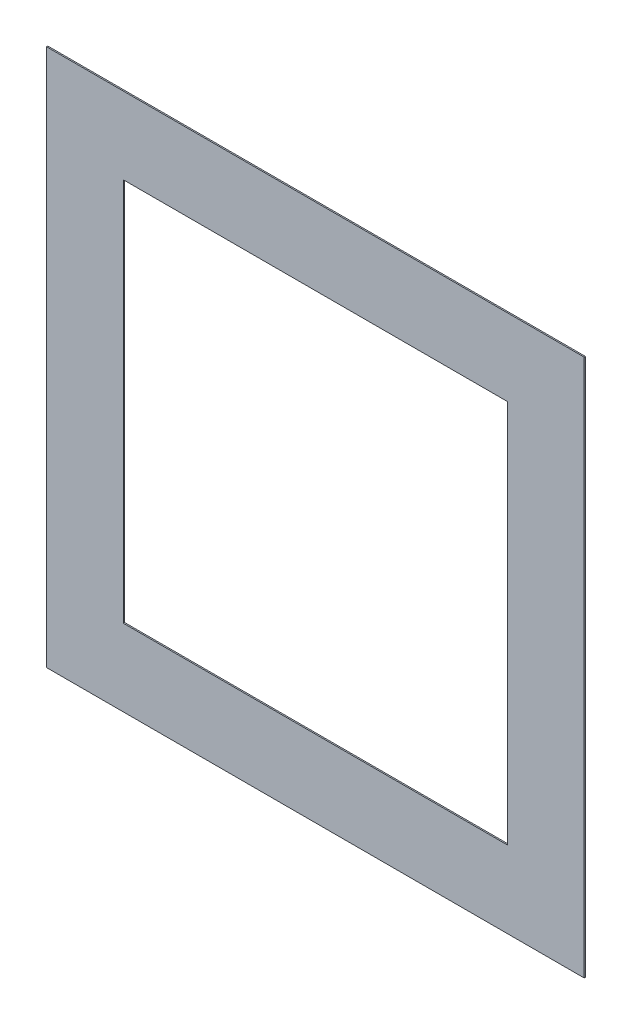
ISO-10303-21;
HEADER;
FILE_DESCRIPTION(('STEP AP214'),'2;1');
FILE_NAME('part.step','',(''),(''),'','','');
FILE_SCHEMA(('AUTOMOTIVE_DESIGN { 1 0 10303 214 1 1 1 1 }'));
ENDSEC;
DATA;
#1=APPLICATION_CONTEXT('core data for automotive mechanical design processes');
#2=APPLICATION_PROTOCOL_DEFINITION('international standard','automotive_design',2000,#1);
#3=PRODUCT_CONTEXT('',#1,'mechanical');
#4=PRODUCT('Part','Part','',(#3));
#5=PRODUCT_RELATED_PRODUCT_CATEGORY('part','',(#4));
#6=PRODUCT_DEFINITION_FORMATION('','',#4);
#7=PRODUCT_DEFINITION_CONTEXT('part definition',#1,'design');
#8=PRODUCT_DEFINITION('design','',#6,#7);
#9=PRODUCT_DEFINITION_SHAPE('','',#8);
#10=(LENGTH_UNIT() NAMED_UNIT(*) SI_UNIT(.MILLI.,.METRE.));
#11=(NAMED_UNIT(*) PLANE_ANGLE_UNIT() SI_UNIT($,.RADIAN.));
#12=(NAMED_UNIT(*) SI_UNIT($,.STERADIAN.) SOLID_ANGLE_UNIT());
#13=UNCERTAINTY_MEASURE_WITH_UNIT(LENGTH_MEASURE(1.E-05),#10,'distance_accuracy_value','');
#14=(GEOMETRIC_REPRESENTATION_CONTEXT(3) GLOBAL_UNCERTAINTY_ASSIGNED_CONTEXT((#13)) GLOBAL_UNIT_ASSIGNED_CONTEXT((#10,
#11,#12)) REPRESENTATION_CONTEXT('',''));
#15=CARTESIAN_POINT('',(0.,0.,0.));
#16=DIRECTION('',(0.,0.,1.));
#17=DIRECTION('',(1.,0.,0.));
#18=AXIS2_PLACEMENT_3D('',#15,#16,#17);
#19=CARTESIAN_POINT('',(-994.520547945205,571.232876712329,5.));
#20=DIRECTION('',(1.,0.,0.));
#21=DIRECTION('',(0.,1.,0.));
#22=AXIS2_PLACEMENT_3D('',#19,#20,#21);
#23=PLANE('',#22);
#24=DIRECTION('',(0.,-1.,0.));
#25=VECTOR('',#24,1.);
#26=CARTESIAN_POINT('',(-994.520547945205,571.232876712329,0.));
#27=LINE('',#26,#25);
#28=CARTESIAN_POINT('',(-994.520547945205,571.232876712329,0.));
#29=VERTEX_POINT('',#28);
#30=CARTESIAN_POINT('',(-994.520547945205,-1528.76712328767,0.));
#31=VERTEX_POINT('',#30);
#32=EDGE_CURVE('E132',#29,#31,#27,.T.);
#33=ORIENTED_EDGE('',*,*,#32,.T.);
#34=DIRECTION('',(0.,0.,-1.));
#35=VECTOR('',#34,1.);
#36=CARTESIAN_POINT('',(-994.520547945205,-1528.76712328767,5.));
#37=LINE('',#36,#35);
#38=CARTESIAN_POINT('',(-994.520547945205,-1528.76712328767,5.));
#39=VERTEX_POINT('',#38);
#40=EDGE_CURVE('E11',#39,#31,#37,.T.);
#41=ORIENTED_EDGE('',*,*,#40,.F.);
#42=DIRECTION('',(0.,-1.,0.));
#43=VECTOR('',#42,1.);
#44=CARTESIAN_POINT('',(-994.520547945205,571.232876712329,5.));
#45=LINE('',#44,#43);
#46=CARTESIAN_POINT('',(-994.520547945205,571.232876712329,5.));
#47=VERTEX_POINT('',#46);
#48=EDGE_CURVE('E136',#47,#39,#45,.T.);
#49=ORIENTED_EDGE('',*,*,#48,.F.);
#50=DIRECTION('',(0.,0.,-1.));
#51=VECTOR('',#50,1.);
#52=CARTESIAN_POINT('',(-994.520547945205,571.232876712329,5.));
#53=LINE('',#52,#51);
#54=EDGE_CURVE('E146',#47,#29,#53,.T.);
#55=ORIENTED_EDGE('',*,*,#54,.T.);
#56=EDGE_LOOP('',(#33,#41,#49,#55));
#57=FACE_BOUND('',#56,.T.);
#58=ADVANCED_FACE('F36',(#57),#23,.F.);
#59=CARTESIAN_POINT('',(-994.520547945205,-1528.76712328767,5.));
#60=DIRECTION('',(0.,1.,0.));
#61=DIRECTION('',(0.,0.,1.));
#62=AXIS2_PLACEMENT_3D('',#59,#60,#61);
#63=PLANE('',#62);
#64=DIRECTION('',(1.,0.,0.));
#65=VECTOR('',#64,1.);
#66=CARTESIAN_POINT('',(-994.520547945205,-1528.76712328767,0.));
#67=LINE('',#66,#65);
#68=CARTESIAN_POINT('',(1105.4794520548,-1528.76712328767,0.));
#69=VERTEX_POINT('',#68);
#70=EDGE_CURVE('E149',#31,#69,#67,.T.);
#71=ORIENTED_EDGE('',*,*,#70,.T.);
#72=DIRECTION('',(0.,0.,-1.));
#73=VECTOR('',#72,1.);
#74=CARTESIAN_POINT('',(1105.4794520548,-1528.76712328767,5.));
#75=LINE('',#74,#73);
#76=CARTESIAN_POINT('',(1105.4794520548,-1528.76712328767,5.));
#77=VERTEX_POINT('',#76);
#78=EDGE_CURVE('E43',#77,#69,#75,.T.);
#79=ORIENTED_EDGE('',*,*,#78,.F.);
#80=DIRECTION('',(1.,0.,0.));
#81=VECTOR('',#80,1.);
#82=CARTESIAN_POINT('',(-994.520547945205,-1528.76712328767,5.));
#83=LINE('',#82,#81);
#84=EDGE_CURVE('E139',#39,#77,#83,.T.);
#85=ORIENTED_EDGE('',*,*,#84,.F.);
#86=ORIENTED_EDGE('',*,*,#40,.T.);
#87=EDGE_LOOP('',(#71,#79,#85,#86));
#88=FACE_BOUND('',#87,.T.);
#89=ADVANCED_FACE('F177',(#88),#63,.F.);
#90=CARTESIAN_POINT('',(1105.47945205479,571.232876712329,5.));
#91=DIRECTION('',(-1.,0.,0.));
#92=DIRECTION('',(0.,-1.,0.));
#93=AXIS2_PLACEMENT_3D('',#90,#91,#92);
#94=PLANE('',#93);
#95=DIRECTION('',(0.,1.,0.));
#96=VECTOR('',#95,1.);
#97=CARTESIAN_POINT('',(1105.47945205479,571.232876712329,0.));
#98=LINE('',#97,#96);
#99=CARTESIAN_POINT('',(1105.47945205479,571.232876712329,0.));
#100=VERTEX_POINT('',#99);
#101=EDGE_CURVE('E151',#69,#100,#98,.T.);
#102=ORIENTED_EDGE('',*,*,#101,.T.);
#103=DIRECTION('',(0.,0.,-1.));
#104=VECTOR('',#103,1.);
#105=CARTESIAN_POINT('',(1105.47945205479,571.232876712329,5.));
#106=LINE('',#105,#104);
#107=CARTESIAN_POINT('',(1105.47945205479,571.232876712329,5.));
#108=VERTEX_POINT('',#107);
#109=EDGE_CURVE('E156',#108,#100,#106,.T.);
#110=ORIENTED_EDGE('',*,*,#109,.F.);
#111=DIRECTION('',(0.,1.,0.));
#112=VECTOR('',#111,1.);
#113=CARTESIAN_POINT('',(1105.47945205479,571.232876712329,5.));
#114=LINE('',#113,#112);
#115=EDGE_CURVE('E142',#77,#108,#114,.T.);
#116=ORIENTED_EDGE('',*,*,#115,.F.);
#117=ORIENTED_EDGE('',*,*,#78,.T.);
#118=EDGE_LOOP('',(#102,#110,#116,#117));
#119=FACE_BOUND('',#118,.T.);
#120=ADVANCED_FACE('F163',(#119),#94,.F.);
#121=CARTESIAN_POINT('',(-994.520547945205,571.232876712329,5.));
#122=DIRECTION('',(0.,-1.,0.));
#123=DIRECTION('',(0.,0.,-1.));
#124=AXIS2_PLACEMENT_3D('',#121,#122,#123);
#125=PLANE('',#124);
#126=DIRECTION('',(-1.,0.,0.));
#127=VECTOR('',#126,1.);
#128=CARTESIAN_POINT('',(-994.520547945205,571.232876712329,0.));
#129=LINE('',#128,#127);
#130=EDGE_CURVE('E140',#100,#29,#129,.T.);
#131=ORIENTED_EDGE('',*,*,#130,.T.);
#132=ORIENTED_EDGE('',*,*,#54,.F.);
#133=DIRECTION('',(-1.,0.,0.));
#134=VECTOR('',#133,1.);
#135=CARTESIAN_POINT('',(-994.520547945205,571.232876712329,5.));
#136=LINE('',#135,#134);
#137=EDGE_CURVE('E144',#108,#47,#136,.T.);
#138=ORIENTED_EDGE('',*,*,#137,.F.);
#139=ORIENTED_EDGE('',*,*,#109,.T.);
#140=EDGE_LOOP('',(#131,#132,#138,#139));
#141=FACE_BOUND('',#140,.T.);
#142=ADVANCED_FACE('F170',(#141),#125,.F.);
#143=CARTESIAN_POINT('',(0.,0.,5.));
#144=DIRECTION('',(0.,0.,1.));
#145=DIRECTION('',(1.,0.,0.));
#146=AXIS2_PLACEMENT_3D('',#143,#144,#145);
#147=PLANE('',#146);
#148=DIRECTION('',(1.,0.,0.));
#149=VECTOR('',#148,1.);
#150=CARTESIAN_POINT('',(-694.520547945204,-1228.76712328767,5.));
#151=LINE('',#150,#149);
#152=CARTESIAN_POINT('',(-694.520547945204,-1228.76712328767,5.));
#153=VERTEX_POINT('',#152);
#154=CARTESIAN_POINT('',(805.479452054795,-1228.76712328767,5.));
#155=VERTEX_POINT('',#154);
#156=EDGE_CURVE('E50',#153,#155,#151,.T.);
#157=ORIENTED_EDGE('',*,*,#156,.F.);
#158=DIRECTION('',(0.,-1.,0.));
#159=VECTOR('',#158,1.);
#160=CARTESIAN_POINT('',(-694.520547945205,271.232876712329,5.));
#161=LINE('',#160,#159);
#162=CARTESIAN_POINT('',(-694.520547945205,271.232876712329,5.));
#163=VERTEX_POINT('',#162);
#164=EDGE_CURVE('E117',#163,#153,#161,.T.);
#165=ORIENTED_EDGE('',*,*,#164,.F.);
#166=DIRECTION('',(1.,0.,0.));
#167=VECTOR('',#166,1.);
#168=CARTESIAN_POINT('',(-694.520547945205,271.232876712329,5.));
#169=LINE('',#168,#167);
#170=CARTESIAN_POINT('',(805.479452054795,271.232876712329,5.));
#171=VERTEX_POINT('',#170);
#172=EDGE_CURVE('E120',#163,#171,#169,.T.);
#173=ORIENTED_EDGE('',*,*,#172,.T.);
#174=DIRECTION('',(0.,-1.,0.));
#175=VECTOR('',#174,1.);
#176=CARTESIAN_POINT('',(805.479452054795,271.232876712329,5.));
#177=LINE('',#176,#175);
#178=EDGE_CURVE('E126',#171,#155,#177,.T.);
#179=ORIENTED_EDGE('',*,*,#178,.T.);
#180=EDGE_LOOP('',(#157,#165,#173,#179));
#181=FACE_BOUND('',#180,.T.);
#182=ORIENTED_EDGE('',*,*,#48,.T.);
#183=ORIENTED_EDGE('',*,*,#84,.T.);
#184=ORIENTED_EDGE('',*,*,#115,.T.);
#185=ORIENTED_EDGE('',*,*,#137,.T.);
#186=EDGE_LOOP('',(#182,#183,#184,#185));
#187=FACE_BOUND('',#186,.T.);
#188=ADVANCED_FACE('F176',(#181,#187),#147,.T.);
#189=CARTESIAN_POINT('',(0.,0.,0.));
#190=DIRECTION('',(0.,0.,1.));
#191=DIRECTION('',(1.,0.,0.));
#192=AXIS2_PLACEMENT_3D('',#189,#190,#191);
#193=PLANE('',#192);
#194=DIRECTION('',(0.,-1.,0.));
#195=VECTOR('',#194,1.);
#196=CARTESIAN_POINT('',(-694.520547945205,271.232876712329,0.));
#197=LINE('',#196,#195);
#198=CARTESIAN_POINT('',(-694.520547945205,271.232876712329,0.));
#199=VERTEX_POINT('',#198);
#200=CARTESIAN_POINT('',(-694.520547945204,-1228.76712328767,0.));
#201=VERTEX_POINT('',#200);
#202=EDGE_CURVE('E112',#199,#201,#197,.T.);
#203=ORIENTED_EDGE('',*,*,#202,.T.);
#204=DIRECTION('',(1.,0.,0.));
#205=VECTOR('',#204,1.);
#206=CARTESIAN_POINT('',(-694.520547945204,-1228.76712328767,0.));
#207=LINE('',#206,#205);
#208=CARTESIAN_POINT('',(805.479452054795,-1228.76712328767,0.));
#209=VERTEX_POINT('',#208);
#210=EDGE_CURVE('E107',#201,#209,#207,.T.);
#211=ORIENTED_EDGE('',*,*,#210,.T.);
#212=DIRECTION('',(0.,-1.,0.));
#213=VECTOR('',#212,1.);
#214=CARTESIAN_POINT('',(805.479452054795,271.232876712329,0.));
#215=LINE('',#214,#213);
#216=CARTESIAN_POINT('',(805.479452054795,271.232876712329,0.));
#217=VERTEX_POINT('',#216);
#218=EDGE_CURVE('E99',#217,#209,#215,.T.);
#219=ORIENTED_EDGE('',*,*,#218,.F.);
#220=DIRECTION('',(1.,0.,0.));
#221=VECTOR('',#220,1.);
#222=CARTESIAN_POINT('',(-694.520547945205,271.232876712329,0.));
#223=LINE('',#222,#221);
#224=EDGE_CURVE('E106',#199,#217,#223,.T.);
#225=ORIENTED_EDGE('',*,*,#224,.F.);
#226=EDGE_LOOP('',(#203,#211,#219,#225));
#227=FACE_BOUND('',#226,.T.);
#228=ORIENTED_EDGE('',*,*,#32,.F.);
#229=ORIENTED_EDGE('',*,*,#130,.F.);
#230=ORIENTED_EDGE('',*,*,#101,.F.);
#231=ORIENTED_EDGE('',*,*,#70,.F.);
#232=EDGE_LOOP('',(#228,#229,#230,#231));
#233=FACE_BOUND('',#232,.T.);
#234=ADVANCED_FACE('F114',(#227,#233),#193,.F.);
#235=CARTESIAN_POINT('',(-694.520547945204,-1228.76712328767,0.));
#236=DIRECTION('',(0.,-1.,0.));
#237=DIRECTION('',(0.,0.,-1.));
#238=AXIS2_PLACEMENT_3D('',#235,#236,#237);
#239=PLANE('',#238);
#240=ORIENTED_EDGE('',*,*,#156,.T.);
#241=DIRECTION('',(0.,0.,1.));
#242=VECTOR('',#241,1.);
#243=CARTESIAN_POINT('',(805.479452054795,-1228.76712328767,0.));
#244=LINE('',#243,#242);
#245=EDGE_CURVE('E101',#209,#155,#244,.T.);
#246=ORIENTED_EDGE('',*,*,#245,.F.);
#247=ORIENTED_EDGE('',*,*,#210,.F.);
#248=DIRECTION('',(0.,0.,1.));
#249=VECTOR('',#248,1.);
#250=CARTESIAN_POINT('',(-694.520547945204,-1228.76712328767,0.));
#251=LINE('',#250,#249);
#252=EDGE_CURVE('E130',#201,#153,#251,.T.);
#253=ORIENTED_EDGE('',*,*,#252,.T.);
#254=EDGE_LOOP('',(#240,#246,#247,#253));
#255=FACE_BOUND('',#254,.T.);
#256=ADVANCED_FACE('F110',(#255),#239,.F.);
#257=CARTESIAN_POINT('',(-694.520547945205,271.232876712329,0.));
#258=DIRECTION('',(-1.,0.,0.));
#259=DIRECTION('',(0.,-1.,0.));
#260=AXIS2_PLACEMENT_3D('',#257,#258,#259);
#261=PLANE('',#260);
#262=ORIENTED_EDGE('',*,*,#164,.T.);
#263=ORIENTED_EDGE('',*,*,#252,.F.);
#264=ORIENTED_EDGE('',*,*,#202,.F.);
#265=DIRECTION('',(0.,0.,1.));
#266=VECTOR('',#265,1.);
#267=CARTESIAN_POINT('',(-694.520547945205,271.232876712329,0.));
#268=LINE('',#267,#266);
#269=EDGE_CURVE('E133',#199,#163,#268,.T.);
#270=ORIENTED_EDGE('',*,*,#269,.T.);
#271=EDGE_LOOP('',(#262,#263,#264,#270));
#272=FACE_BOUND('',#271,.T.);
#273=ADVANCED_FACE('F194',(#272),#261,.F.);
#274=CARTESIAN_POINT('',(-694.520547945205,271.232876712329,0.));
#275=DIRECTION('',(0.,-1.,0.));
#276=DIRECTION('',(0.,0.,-1.));
#277=AXIS2_PLACEMENT_3D('',#274,#275,#276);
#278=PLANE('',#277);
#279=ORIENTED_EDGE('',*,*,#172,.F.);
#280=ORIENTED_EDGE('',*,*,#269,.F.);
#281=ORIENTED_EDGE('',*,*,#224,.T.);
#282=DIRECTION('',(0.,0.,1.));
#283=VECTOR('',#282,1.);
#284=CARTESIAN_POINT('',(805.479452054795,271.232876712329,0.));
#285=LINE('',#284,#283);
#286=EDGE_CURVE('E58',#217,#171,#285,.T.);
#287=ORIENTED_EDGE('',*,*,#286,.T.);
#288=EDGE_LOOP('',(#279,#280,#281,#287));
#289=FACE_BOUND('',#288,.T.);
#290=ADVANCED_FACE('F197',(#289),#278,.T.);
#291=CARTESIAN_POINT('',(805.479452054795,271.232876712329,0.));
#292=DIRECTION('',(-1.,0.,0.));
#293=DIRECTION('',(0.,-1.,0.));
#294=AXIS2_PLACEMENT_3D('',#291,#292,#293);
#295=PLANE('',#294);
#296=ORIENTED_EDGE('',*,*,#178,.F.);
#297=ORIENTED_EDGE('',*,*,#286,.F.);
#298=ORIENTED_EDGE('',*,*,#218,.T.);
#299=ORIENTED_EDGE('',*,*,#245,.T.);
#300=EDGE_LOOP('',(#296,#297,#298,#299));
#301=FACE_BOUND('',#300,.T.);
#302=ADVANCED_FACE('F100',(#301),#295,.T.);
#303=CLOSED_SHELL('',(#58,#89,#120,#142,#188,#234,#256,#273,#290,#302));
#304=MANIFOLD_SOLID_BREP('B2',#303);
#305=ADVANCED_BREP_SHAPE_REPRESENTATION('',(#18,#304),#14);
#306=SHAPE_DEFINITION_REPRESENTATION(#9,#305);
ENDSEC;
END-ISO-10303-21;
